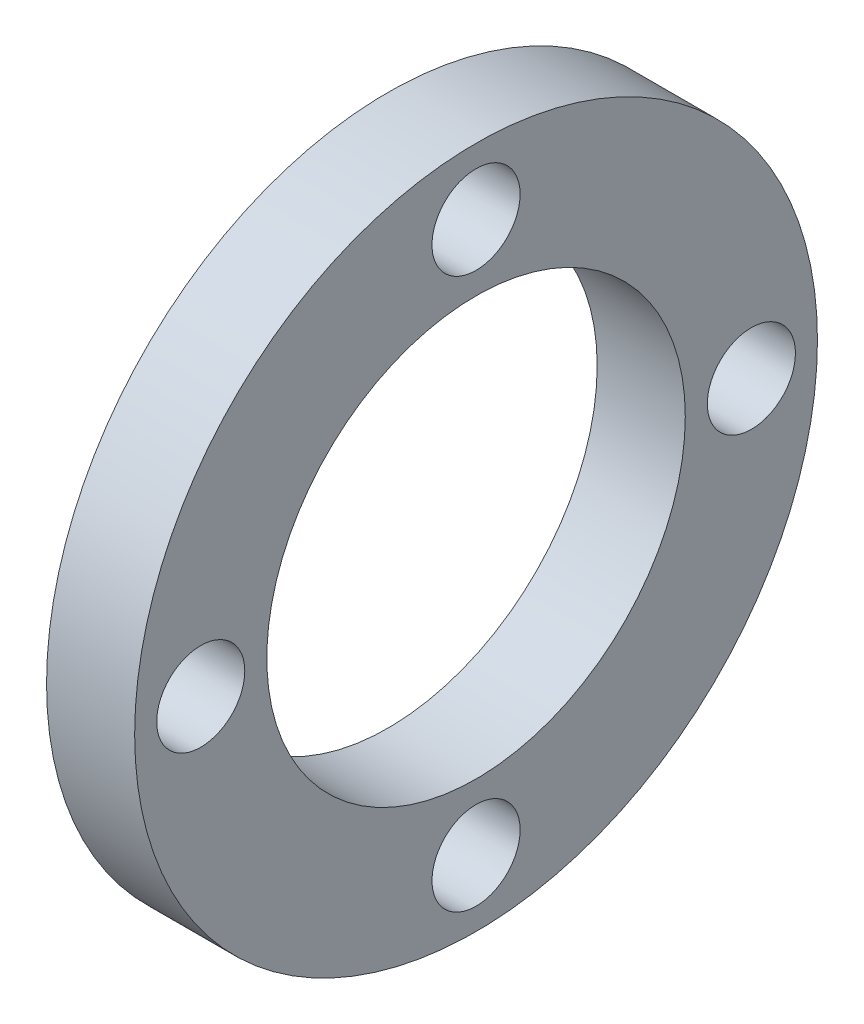
ISO-10303-21;
HEADER;
FILE_DESCRIPTION(('STEP AP214'),'2;1');
FILE_NAME('part.step','',(''),(''),'','','');
FILE_SCHEMA(('AUTOMOTIVE_DESIGN { 1 0 10303 214 1 1 1 1 }'));
ENDSEC;
DATA;
#1=APPLICATION_CONTEXT('core data for automotive mechanical design processes');
#2=APPLICATION_PROTOCOL_DEFINITION('international standard','automotive_design',2000,#1);
#3=PRODUCT_CONTEXT('',#1,'mechanical');
#4=PRODUCT('Part','Part','',(#3));
#5=PRODUCT_RELATED_PRODUCT_CATEGORY('part','',(#4));
#6=PRODUCT_DEFINITION_FORMATION('','',#4);
#7=PRODUCT_DEFINITION_CONTEXT('part definition',#1,'design');
#8=PRODUCT_DEFINITION('design','',#6,#7);
#9=PRODUCT_DEFINITION_SHAPE('','',#8);
#10=(LENGTH_UNIT() NAMED_UNIT(*) SI_UNIT(.MILLI.,.METRE.));
#11=(NAMED_UNIT(*) PLANE_ANGLE_UNIT() SI_UNIT($,.RADIAN.));
#12=(NAMED_UNIT(*) SI_UNIT($,.STERADIAN.) SOLID_ANGLE_UNIT());
#13=UNCERTAINTY_MEASURE_WITH_UNIT(LENGTH_MEASURE(1.E-05),#10,'distance_accuracy_value','');
#14=(GEOMETRIC_REPRESENTATION_CONTEXT(3) GLOBAL_UNCERTAINTY_ASSIGNED_CONTEXT((#13)) GLOBAL_UNIT_ASSIGNED_CONTEXT((#10,
#11,#12)) REPRESENTATION_CONTEXT('',''));
#15=CARTESIAN_POINT('',(0.,0.,0.));
#16=DIRECTION('',(0.,0.,1.));
#17=DIRECTION('',(1.,0.,0.));
#18=AXIS2_PLACEMENT_3D('',#15,#16,#17);
#19=CARTESIAN_POINT('',(8.,0.,0.));
#20=DIRECTION('',(1.,0.,0.));
#21=DIRECTION('',(0.,0.,-1.));
#22=AXIS2_PLACEMENT_3D('',#19,#20,#21);
#23=PLANE('',#22);
#24=CARTESIAN_POINT('',(8.,-25.,-1.41496223752446E-12));
#25=DIRECTION('',(1.,0.,0.));
#26=DIRECTION('',(0.,0.,-1.));
#27=AXIS2_PLACEMENT_3D('',#24,#25,#26);
#28=CIRCLE('',#27,4.00000000000152);
#29=CARTESIAN_POINT('',(8.,-25.,-4.00000000000293));
#30=VERTEX_POINT('',#29);
#31=EDGE_CURVE('E72',#30,#30,#28,.T.);
#32=ORIENTED_EDGE('',*,*,#31,.F.);
#33=EDGE_LOOP('',(#32));
#34=FACE_BOUND('',#33,.T.);
#35=CARTESIAN_POINT('',(8.,25.,0.));
#36=DIRECTION('',(1.,0.,0.));
#37=DIRECTION('',(0.,0.,-1.));
#38=AXIS2_PLACEMENT_3D('',#35,#36,#37);
#39=CIRCLE('',#38,4.);
#40=CARTESIAN_POINT('',(8.,25.,-4.));
#41=VERTEX_POINT('',#40);
#42=EDGE_CURVE('E60',#41,#41,#39,.T.);
#43=ORIENTED_EDGE('',*,*,#42,.F.);
#44=EDGE_LOOP('',(#43));
#45=FACE_BOUND('',#44,.T.);
#46=CARTESIAN_POINT('',(8.,0.,0.));
#47=DIRECTION('',(1.,0.,0.));
#48=DIRECTION('',(0.,0.,-1.));
#49=AXIS2_PLACEMENT_3D('',#46,#47,#48);
#50=CIRCLE('',#49,31.);
#51=CARTESIAN_POINT('',(8.,0.,-31.));
#52=VERTEX_POINT('',#51);
#53=EDGE_CURVE('E12',#52,#52,#50,.T.);
#54=ORIENTED_EDGE('',*,*,#53,.T.);
#55=EDGE_LOOP('',(#54));
#56=FACE_BOUND('',#55,.T.);
#57=CARTESIAN_POINT('',(8.,0.,0.));
#58=DIRECTION('',(1.,0.,0.));
#59=DIRECTION('',(0.,0.,-1.));
#60=AXIS2_PLACEMENT_3D('',#57,#58,#59);
#61=CIRCLE('',#60,19.);
#62=CARTESIAN_POINT('',(8.,0.,-19.));
#63=VERTEX_POINT('',#62);
#64=EDGE_CURVE('E55',#63,#63,#61,.T.);
#65=ORIENTED_EDGE('',*,*,#64,.F.);
#66=EDGE_LOOP('',(#65));
#67=FACE_BOUND('',#66,.T.);
#68=CARTESIAN_POINT('',(8.,7.07481118762232E-13,-25.0000000000007));
#69=DIRECTION('',(1.,0.,0.));
#70=DIRECTION('',(0.,0.,-1.));
#71=AXIS2_PLACEMENT_3D('',#68,#69,#70);
#72=CIRCLE('',#71,4.00000000000055);
#73=CARTESIAN_POINT('',(8.,7.07481118762232E-13,-29.0000000000013));
#74=VERTEX_POINT('',#73);
#75=EDGE_CURVE('E66',#74,#74,#72,.T.);
#76=ORIENTED_EDGE('',*,*,#75,.F.);
#77=EDGE_LOOP('',(#76));
#78=FACE_BOUND('',#77,.T.);
#79=CARTESIAN_POINT('',(8.,-7.105427357601E-13,24.9999999999993));
#80=DIRECTION('',(1.,0.,0.));
#81=DIRECTION('',(0.,0.,-1.));
#82=AXIS2_PLACEMENT_3D('',#79,#80,#81);
#83=CIRCLE('',#82,4.00000000000113);
#84=CARTESIAN_POINT('',(8.,-7.105427357601E-13,20.9999999999982));
#85=VERTEX_POINT('',#84);
#86=EDGE_CURVE('E78',#85,#85,#83,.T.);
#87=ORIENTED_EDGE('',*,*,#86,.F.);
#88=EDGE_LOOP('',(#87));
#89=FACE_BOUND('',#88,.T.);
#90=ADVANCED_FACE('F44',(#34,#45,#56,#67,#78,#89),#23,.T.);
#91=CARTESIAN_POINT('',(0.,0.,0.));
#92=DIRECTION('',(1.,0.,0.));
#93=DIRECTION('',(0.,0.,-1.));
#94=AXIS2_PLACEMENT_3D('',#91,#92,#93);
#95=PLANE('',#94);
#96=CARTESIAN_POINT('',(0.,0.,0.));
#97=DIRECTION('',(1.,0.,0.));
#98=DIRECTION('',(0.,0.,-1.));
#99=AXIS2_PLACEMENT_3D('',#96,#97,#98);
#100=CIRCLE('',#99,31.);
#101=CARTESIAN_POINT('',(0.,0.,-31.));
#102=VERTEX_POINT('',#101);
#103=EDGE_CURVE('E48',#102,#102,#100,.T.);
#104=ORIENTED_EDGE('',*,*,#103,.F.);
#105=EDGE_LOOP('',(#104));
#106=FACE_BOUND('',#105,.T.);
#107=CARTESIAN_POINT('',(0.,0.,0.));
#108=DIRECTION('',(1.,0.,0.));
#109=DIRECTION('',(0.,0.,-1.));
#110=AXIS2_PLACEMENT_3D('',#107,#108,#109);
#111=CIRCLE('',#110,19.);
#112=CARTESIAN_POINT('',(0.,0.,-19.));
#113=VERTEX_POINT('',#112);
#114=EDGE_CURVE('E57',#113,#113,#111,.T.);
#115=ORIENTED_EDGE('',*,*,#114,.T.);
#116=EDGE_LOOP('',(#115));
#117=FACE_BOUND('',#116,.T.);
#118=CARTESIAN_POINT('',(0.,25.,0.));
#119=DIRECTION('',(1.,0.,0.));
#120=DIRECTION('',(0.,0.,-1.));
#121=AXIS2_PLACEMENT_3D('',#118,#119,#120);
#122=CIRCLE('',#121,4.);
#123=CARTESIAN_POINT('',(0.,25.,-4.));
#124=VERTEX_POINT('',#123);
#125=EDGE_CURVE('E63',#124,#124,#122,.T.);
#126=ORIENTED_EDGE('',*,*,#125,.T.);
#127=EDGE_LOOP('',(#126));
#128=FACE_BOUND('',#127,.T.);
#129=CARTESIAN_POINT('',(0.,7.07481118762232E-13,-25.0000000000007));
#130=DIRECTION('',(1.,0.,0.));
#131=DIRECTION('',(0.,0.,-1.));
#132=AXIS2_PLACEMENT_3D('',#129,#130,#131);
#133=CIRCLE('',#132,4.00000000000055);
#134=CARTESIAN_POINT('',(0.,7.07481118762232E-13,-29.0000000000013));
#135=VERTEX_POINT('',#134);
#136=EDGE_CURVE('E69',#135,#135,#133,.T.);
#137=ORIENTED_EDGE('',*,*,#136,.T.);
#138=EDGE_LOOP('',(#137));
#139=FACE_BOUND('',#138,.T.);
#140=CARTESIAN_POINT('',(0.,-25.,-1.41496223752446E-12));
#141=DIRECTION('',(1.,0.,0.));
#142=DIRECTION('',(0.,0.,-1.));
#143=AXIS2_PLACEMENT_3D('',#140,#141,#142);
#144=CIRCLE('',#143,4.00000000000152);
#145=CARTESIAN_POINT('',(0.,-25.,-4.00000000000293));
#146=VERTEX_POINT('',#145);
#147=EDGE_CURVE('E75',#146,#146,#144,.T.);
#148=ORIENTED_EDGE('',*,*,#147,.T.);
#149=EDGE_LOOP('',(#148));
#150=FACE_BOUND('',#149,.T.);
#151=CARTESIAN_POINT('',(0.,-7.105427357601E-13,24.9999999999993));
#152=DIRECTION('',(1.,0.,0.));
#153=DIRECTION('',(0.,0.,-1.));
#154=AXIS2_PLACEMENT_3D('',#151,#152,#153);
#155=CIRCLE('',#154,4.00000000000113);
#156=CARTESIAN_POINT('',(0.,-7.105427357601E-13,20.9999999999982));
#157=VERTEX_POINT('',#156);
#158=EDGE_CURVE('E81',#157,#157,#155,.T.);
#159=ORIENTED_EDGE('',*,*,#158,.T.);
#160=EDGE_LOOP('',(#159));
#161=FACE_BOUND('',#160,.T.);
#162=ADVANCED_FACE('F91',(#106,#117,#128,#139,#150,#161),#95,.F.);
#163=CARTESIAN_POINT('',(8.,0.,0.));
#164=DIRECTION('',(-1.,0.,0.));
#165=DIRECTION('',(0.,0.,1.));
#166=AXIS2_PLACEMENT_3D('',#163,#164,#165);
#167=CYLINDRICAL_SURFACE('',#166,31.);
#168=ORIENTED_EDGE('',*,*,#53,.F.);
#169=EDGE_LOOP('',(#168));
#170=FACE_BOUND('',#169,.T.);
#171=ORIENTED_EDGE('',*,*,#103,.T.);
#172=EDGE_LOOP('',(#171));
#173=FACE_BOUND('',#172,.T.);
#174=ADVANCED_FACE('F46',(#170,#173),#167,.T.);
#175=CARTESIAN_POINT('',(8.,0.,0.));
#176=DIRECTION('',(-1.,0.,0.));
#177=DIRECTION('',(0.,0.,1.));
#178=AXIS2_PLACEMENT_3D('',#175,#176,#177);
#179=CYLINDRICAL_SURFACE('',#178,19.);
#180=ORIENTED_EDGE('',*,*,#64,.T.);
#181=EDGE_LOOP('',(#180));
#182=FACE_BOUND('',#181,.T.);
#183=ORIENTED_EDGE('',*,*,#114,.F.);
#184=EDGE_LOOP('',(#183));
#185=FACE_BOUND('',#184,.T.);
#186=ADVANCED_FACE('F101',(#182,#185),#179,.F.);
#187=CARTESIAN_POINT('',(8.,25.,0.));
#188=DIRECTION('',(-1.,0.,0.));
#189=DIRECTION('',(0.,0.,1.));
#190=AXIS2_PLACEMENT_3D('',#187,#188,#189);
#191=CYLINDRICAL_SURFACE('',#190,4.);
#192=ORIENTED_EDGE('',*,*,#42,.T.);
#193=EDGE_LOOP('',(#192));
#194=FACE_BOUND('',#193,.T.);
#195=ORIENTED_EDGE('',*,*,#125,.F.);
#196=EDGE_LOOP('',(#195));
#197=FACE_BOUND('',#196,.T.);
#198=ADVANCED_FACE('F104',(#194,#197),#191,.F.);
#199=CARTESIAN_POINT('',(8.,7.07481118762232E-13,-25.0000000000007));
#200=DIRECTION('',(-1.,0.,0.));
#201=DIRECTION('',(0.,0.,1.));
#202=AXIS2_PLACEMENT_3D('',#199,#200,#201);
#203=CYLINDRICAL_SURFACE('',#202,4.00000000000055);
#204=ORIENTED_EDGE('',*,*,#75,.T.);
#205=EDGE_LOOP('',(#204));
#206=FACE_BOUND('',#205,.T.);
#207=ORIENTED_EDGE('',*,*,#136,.F.);
#208=EDGE_LOOP('',(#207));
#209=FACE_BOUND('',#208,.T.);
#210=ADVANCED_FACE('F108',(#206,#209),#203,.F.);
#211=CARTESIAN_POINT('',(8.,-25.,-1.41496223752446E-12));
#212=DIRECTION('',(-1.,0.,0.));
#213=DIRECTION('',(0.,0.,1.));
#214=AXIS2_PLACEMENT_3D('',#211,#212,#213);
#215=CYLINDRICAL_SURFACE('',#214,4.00000000000152);
#216=ORIENTED_EDGE('',*,*,#31,.T.);
#217=EDGE_LOOP('',(#216));
#218=FACE_BOUND('',#217,.T.);
#219=ORIENTED_EDGE('',*,*,#147,.F.);
#220=EDGE_LOOP('',(#219));
#221=FACE_BOUND('',#220,.T.);
#222=ADVANCED_FACE('F112',(#218,#221),#215,.F.);
#223=CARTESIAN_POINT('',(8.,-7.105427357601E-13,24.9999999999993));
#224=DIRECTION('',(-1.,0.,0.));
#225=DIRECTION('',(0.,0.,1.));
#226=AXIS2_PLACEMENT_3D('',#223,#224,#225);
#227=CYLINDRICAL_SURFACE('',#226,4.00000000000113);
#228=ORIENTED_EDGE('',*,*,#86,.T.);
#229=EDGE_LOOP('',(#228));
#230=FACE_BOUND('',#229,.T.);
#231=ORIENTED_EDGE('',*,*,#158,.F.);
#232=EDGE_LOOP('',(#231));
#233=FACE_BOUND('',#232,.T.);
#234=ADVANCED_FACE('F87',(#230,#233),#227,.F.);
#235=CLOSED_SHELL('',(#90,#162,#174,#186,#198,#210,#222,#234));
#236=MANIFOLD_SOLID_BREP('B2',#235);
#237=ADVANCED_BREP_SHAPE_REPRESENTATION('',(#18,#236),#14);
#238=SHAPE_DEFINITION_REPRESENTATION(#9,#237);
ENDSEC;
END-ISO-10303-21;
